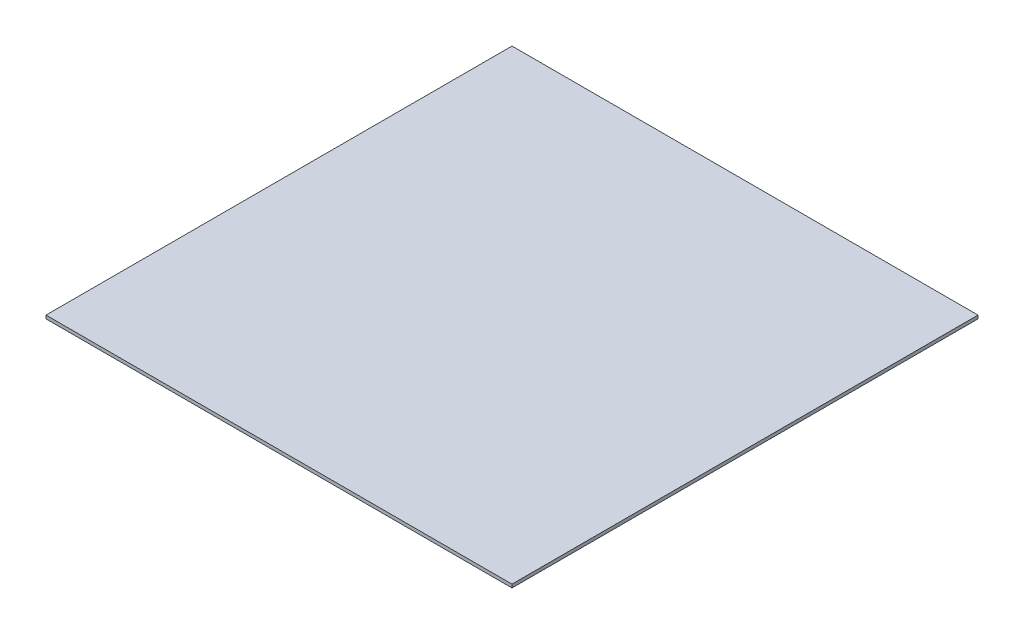
ISO-10303-21;
HEADER;
FILE_DESCRIPTION(('STEP AP214'),'2;1');
FILE_NAME('part.step','',(''),(''),'','','');
FILE_SCHEMA(('AUTOMOTIVE_DESIGN { 1 0 10303 214 1 1 1 1 }'));
ENDSEC;
DATA;
#1=APPLICATION_CONTEXT('core data for automotive mechanical design processes');
#2=APPLICATION_PROTOCOL_DEFINITION('international standard','automotive_design',2000,#1);
#3=PRODUCT_CONTEXT('',#1,'mechanical');
#4=PRODUCT('Part','Part','',(#3));
#5=PRODUCT_RELATED_PRODUCT_CATEGORY('part','',(#4));
#6=PRODUCT_DEFINITION_FORMATION('','',#4);
#7=PRODUCT_DEFINITION_CONTEXT('part definition',#1,'design');
#8=PRODUCT_DEFINITION('design','',#6,#7);
#9=PRODUCT_DEFINITION_SHAPE('','',#8);
#10=(LENGTH_UNIT() NAMED_UNIT(*) SI_UNIT(.MILLI.,.METRE.));
#11=(NAMED_UNIT(*) PLANE_ANGLE_UNIT() SI_UNIT($,.RADIAN.));
#12=(NAMED_UNIT(*) SI_UNIT($,.STERADIAN.) SOLID_ANGLE_UNIT());
#13=UNCERTAINTY_MEASURE_WITH_UNIT(LENGTH_MEASURE(1.E-05),#10,'distance_accuracy_value','');
#14=(GEOMETRIC_REPRESENTATION_CONTEXT(3) GLOBAL_UNCERTAINTY_ASSIGNED_CONTEXT((#13)) GLOBAL_UNIT_ASSIGNED_CONTEXT((#10,
#11,#12)) REPRESENTATION_CONTEXT('',''));
#15=CARTESIAN_POINT('',(0.,0.,0.));
#16=DIRECTION('',(0.,0.,1.));
#17=DIRECTION('',(1.,0.,0.));
#18=AXIS2_PLACEMENT_3D('',#15,#16,#17);
#19=CARTESIAN_POINT('',(0.,0.762,0.));
#20=DIRECTION('',(1.,0.,0.));
#21=DIRECTION('',(0.,0.,-1.));
#22=AXIS2_PLACEMENT_3D('',#19,#20,#21);
#23=PLANE('',#22);
#24=DIRECTION('',(0.,0.,1.));
#25=VECTOR('',#24,1.);
#26=CARTESIAN_POINT('',(0.,0.,0.));
#27=LINE('',#26,#25);
#28=CARTESIAN_POINT('',(0.,0.,-107.07));
#29=VERTEX_POINT('',#28);
#30=CARTESIAN_POINT('',(0.,0.,0.));
#31=VERTEX_POINT('',#30);
#32=EDGE_CURVE('E96',#29,#31,#27,.T.);
#33=ORIENTED_EDGE('',*,*,#32,.T.);
#34=DIRECTION('',(0.,-1.,0.));
#35=VECTOR('',#34,1.);
#36=CARTESIAN_POINT('',(0.,0.762,0.));
#37=LINE('',#36,#35);
#38=CARTESIAN_POINT('',(0.,0.762,0.));
#39=VERTEX_POINT('',#38);
#40=EDGE_CURVE('E11',#39,#31,#37,.T.);
#41=ORIENTED_EDGE('',*,*,#40,.F.);
#42=DIRECTION('',(0.,0.,1.));
#43=VECTOR('',#42,1.);
#44=CARTESIAN_POINT('',(0.,0.762,0.));
#45=LINE('',#44,#43);
#46=CARTESIAN_POINT('',(0.,0.762,-107.07));
#47=VERTEX_POINT('',#46);
#48=EDGE_CURVE('E84',#47,#39,#45,.T.);
#49=ORIENTED_EDGE('',*,*,#48,.F.);
#50=DIRECTION('',(0.,-1.,0.));
#51=VECTOR('',#50,1.);
#52=CARTESIAN_POINT('',(0.,0.762,-107.07));
#53=LINE('',#52,#51);
#54=EDGE_CURVE('E92',#47,#29,#53,.T.);
#55=ORIENTED_EDGE('',*,*,#54,.T.);
#56=EDGE_LOOP('',(#33,#41,#49,#55));
#57=FACE_BOUND('',#56,.T.);
#58=ADVANCED_FACE('F33',(#57),#23,.F.);
#59=CARTESIAN_POINT('',(0.,0.762,0.));
#60=DIRECTION('',(0.,0.,-1.));
#61=DIRECTION('',(-1.,0.,0.));
#62=AXIS2_PLACEMENT_3D('',#59,#60,#61);
#63=PLANE('',#62);
#64=DIRECTION('',(1.,0.,0.));
#65=VECTOR('',#64,1.);
#66=CARTESIAN_POINT('',(0.,0.,0.));
#67=LINE('',#66,#65);
#68=CARTESIAN_POINT('',(107.07,0.,0.));
#69=VERTEX_POINT('',#68);
#70=EDGE_CURVE('E88',#31,#69,#67,.T.);
#71=ORIENTED_EDGE('',*,*,#70,.T.);
#72=DIRECTION('',(0.,-1.,0.));
#73=VECTOR('',#72,1.);
#74=CARTESIAN_POINT('',(107.07,0.762,0.));
#75=LINE('',#74,#73);
#76=CARTESIAN_POINT('',(107.07,0.762,0.));
#77=VERTEX_POINT('',#76);
#78=EDGE_CURVE('E41',#77,#69,#75,.T.);
#79=ORIENTED_EDGE('',*,*,#78,.F.);
#80=DIRECTION('',(1.,0.,0.));
#81=VECTOR('',#80,1.);
#82=CARTESIAN_POINT('',(0.,0.762,0.));
#83=LINE('',#82,#81);
#84=EDGE_CURVE('E79',#39,#77,#83,.T.);
#85=ORIENTED_EDGE('',*,*,#84,.F.);
#86=ORIENTED_EDGE('',*,*,#40,.T.);
#87=EDGE_LOOP('',(#71,#79,#85,#86));
#88=FACE_BOUND('',#87,.T.);
#89=ADVANCED_FACE('F87',(#88),#63,.F.);
#90=CARTESIAN_POINT('',(107.07,0.762,-107.07));
#91=DIRECTION('',(-1.,0.,0.));
#92=DIRECTION('',(0.,0.,1.));
#93=AXIS2_PLACEMENT_3D('',#90,#91,#92);
#94=PLANE('',#93);
#95=DIRECTION('',(0.,0.,-1.));
#96=VECTOR('',#95,1.);
#97=CARTESIAN_POINT('',(107.07,0.,-107.07));
#98=LINE('',#97,#96);
#99=CARTESIAN_POINT('',(107.07,0.,-107.07));
#100=VERTEX_POINT('',#99);
#101=EDGE_CURVE('E66',#69,#100,#98,.T.);
#102=ORIENTED_EDGE('',*,*,#101,.T.);
#103=DIRECTION('',(0.,-1.,0.));
#104=VECTOR('',#103,1.);
#105=CARTESIAN_POINT('',(107.07,0.762,-107.07));
#106=LINE('',#105,#104);
#107=CARTESIAN_POINT('',(107.07,0.762,-107.07));
#108=VERTEX_POINT('',#107);
#109=EDGE_CURVE('E89',#108,#100,#106,.T.);
#110=ORIENTED_EDGE('',*,*,#109,.F.);
#111=DIRECTION('',(0.,0.,-1.));
#112=VECTOR('',#111,1.);
#113=CARTESIAN_POINT('',(107.07,0.762,-107.07));
#114=LINE('',#113,#112);
#115=EDGE_CURVE('E82',#77,#108,#114,.T.);
#116=ORIENTED_EDGE('',*,*,#115,.F.);
#117=ORIENTED_EDGE('',*,*,#78,.T.);
#118=EDGE_LOOP('',(#102,#110,#116,#117));
#119=FACE_BOUND('',#118,.T.);
#120=ADVANCED_FACE('F90',(#119),#94,.F.);
#121=CARTESIAN_POINT('',(0.,0.762,-107.07));
#122=DIRECTION('',(0.,0.,1.));
#123=DIRECTION('',(1.,0.,0.));
#124=AXIS2_PLACEMENT_3D('',#121,#122,#123);
#125=PLANE('',#124);
#126=DIRECTION('',(-1.,0.,0.));
#127=VECTOR('',#126,1.);
#128=CARTESIAN_POINT('',(0.,0.,-107.07));
#129=LINE('',#128,#127);
#130=EDGE_CURVE('E72',#100,#29,#129,.T.);
#131=ORIENTED_EDGE('',*,*,#130,.T.);
#132=ORIENTED_EDGE('',*,*,#54,.F.);
#133=DIRECTION('',(-1.,0.,0.));
#134=VECTOR('',#133,1.);
#135=CARTESIAN_POINT('',(0.,0.762,-107.07));
#136=LINE('',#135,#134);
#137=EDGE_CURVE('E49',#108,#47,#136,.T.);
#138=ORIENTED_EDGE('',*,*,#137,.F.);
#139=ORIENTED_EDGE('',*,*,#109,.T.);
#140=EDGE_LOOP('',(#131,#132,#138,#139));
#141=FACE_BOUND('',#140,.T.);
#142=ADVANCED_FACE('F103',(#141),#125,.F.);
#143=CARTESIAN_POINT('',(0.,0.762,0.));
#144=DIRECTION('',(0.,-1.,0.));
#145=DIRECTION('',(0.,0.,-1.));
#146=AXIS2_PLACEMENT_3D('',#143,#144,#145);
#147=PLANE('',#146);
#148=ORIENTED_EDGE('',*,*,#48,.T.);
#149=ORIENTED_EDGE('',*,*,#84,.T.);
#150=ORIENTED_EDGE('',*,*,#115,.T.);
#151=ORIENTED_EDGE('',*,*,#137,.T.);
#152=EDGE_LOOP('',(#148,#149,#150,#151));
#153=FACE_BOUND('',#152,.T.);
#154=ADVANCED_FACE('F80',(#153),#147,.F.);
#155=CARTESIAN_POINT('',(0.,0.,0.));
#156=DIRECTION('',(0.,-1.,0.));
#157=DIRECTION('',(0.,0.,-1.));
#158=AXIS2_PLACEMENT_3D('',#155,#156,#157);
#159=PLANE('',#158);
#160=ORIENTED_EDGE('',*,*,#32,.F.);
#161=ORIENTED_EDGE('',*,*,#130,.F.);
#162=ORIENTED_EDGE('',*,*,#101,.F.);
#163=ORIENTED_EDGE('',*,*,#70,.F.);
#164=EDGE_LOOP('',(#160,#161,#162,#163));
#165=FACE_BOUND('',#164,.T.);
#166=ADVANCED_FACE('F106',(#165),#159,.T.);
#167=CLOSED_SHELL('',(#58,#89,#120,#142,#154,#166));
#168=MANIFOLD_SOLID_BREP('B2',#167);
#169=ADVANCED_BREP_SHAPE_REPRESENTATION('',(#18,#168),#14);
#170=SHAPE_DEFINITION_REPRESENTATION(#9,#169);
ENDSEC;
END-ISO-10303-21;
